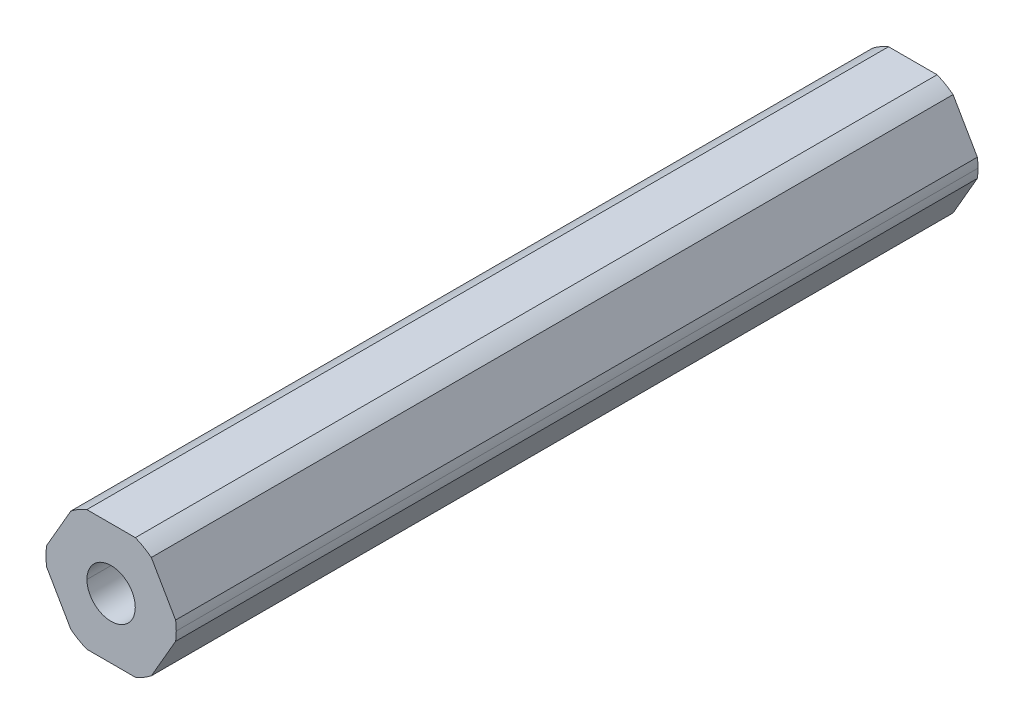
ISO-10303-21;
HEADER;
FILE_DESCRIPTION(('STEP AP214'),'2;1');
FILE_NAME('part.step','',(''),(''),'','','');
FILE_SCHEMA(('AUTOMOTIVE_DESIGN { 1 0 10303 214 1 1 1 1 }'));
ENDSEC;
DATA;
#1=APPLICATION_CONTEXT('core data for automotive mechanical design processes');
#2=APPLICATION_PROTOCOL_DEFINITION('international standard','automotive_design',2000,#1);
#3=PRODUCT_CONTEXT('',#1,'mechanical');
#4=PRODUCT('Part','Part','',(#3));
#5=PRODUCT_RELATED_PRODUCT_CATEGORY('part','',(#4));
#6=PRODUCT_DEFINITION_FORMATION('','',#4);
#7=PRODUCT_DEFINITION_CONTEXT('part definition',#1,'design');
#8=PRODUCT_DEFINITION('design','',#6,#7);
#9=PRODUCT_DEFINITION_SHAPE('','',#8);
#10=(LENGTH_UNIT() NAMED_UNIT(*) SI_UNIT(.MILLI.,.METRE.));
#11=(NAMED_UNIT(*) PLANE_ANGLE_UNIT() SI_UNIT($,.RADIAN.));
#12=(NAMED_UNIT(*) SI_UNIT($,.STERADIAN.) SOLID_ANGLE_UNIT());
#13=UNCERTAINTY_MEASURE_WITH_UNIT(LENGTH_MEASURE(1.E-05),#10,'distance_accuracy_value','');
#14=(GEOMETRIC_REPRESENTATION_CONTEXT(3) GLOBAL_UNCERTAINTY_ASSIGNED_CONTEXT((#13)) GLOBAL_UNIT_ASSIGNED_CONTEXT((#10,
#11,#12)) REPRESENTATION_CONTEXT('',''));
#15=CARTESIAN_POINT('',(0.,0.,0.));
#16=DIRECTION('',(0.,0.,1.));
#17=DIRECTION('',(1.,0.,0.));
#18=AXIS2_PLACEMENT_3D('',#15,#16,#17);
#19=CARTESIAN_POINT('',(0.,0.,-228.6));
#20=DIRECTION('',(0.,0.,1.));
#21=DIRECTION('',(1.,0.,0.));
#22=AXIS2_PLACEMENT_3D('',#19,#20,#21);
#23=CYLINDRICAL_SURFACE('',#22,2.55);
#24=DIRECTION('',(0.,0.,1.));
#25=VECTOR('',#24,1.);
#26=CARTESIAN_POINT('',(-2.55,0.,-228.6));
#27=LINE('',#26,#25);
#28=CARTESIAN_POINT('',(-2.55,0.,-228.6));
#29=VERTEX_POINT('',#28);
#30=CARTESIAN_POINT('',(-2.55,0.,-144.0764));
#31=VERTEX_POINT('',#30);
#32=EDGE_CURVE('E46',#29,#31,#27,.T.);
#33=ORIENTED_EDGE('',*,*,#32,.T.);
#34=CARTESIAN_POINT('',(0.,0.,-144.0764));
#35=DIRECTION('',(0.,0.,-1.));
#36=DIRECTION('',(-1.,0.,0.));
#37=AXIS2_PLACEMENT_3D('',#34,#35,#36);
#38=CIRCLE('',#37,2.55);
#39=CARTESIAN_POINT('',(2.55,0.,-144.0764));
#40=VERTEX_POINT('',#39);
#41=EDGE_CURVE('E60',#31,#40,#38,.F.);
#42=ORIENTED_EDGE('',*,*,#41,.T.);
#43=DIRECTION('',(0.,0.,1.));
#44=VECTOR('',#43,1.);
#45=CARTESIAN_POINT('',(2.55,0.,-228.6));
#46=LINE('',#45,#44);
#47=CARTESIAN_POINT('',(2.55,0.,-228.6));
#48=VERTEX_POINT('',#47);
#49=EDGE_CURVE('E192',#48,#40,#46,.T.);
#50=ORIENTED_EDGE('',*,*,#49,.F.);
#51=CARTESIAN_POINT('',(0.,0.,-228.6));
#52=DIRECTION('',(0.,0.,1.));
#53=DIRECTION('',(1.,0.,0.));
#54=AXIS2_PLACEMENT_3D('',#51,#52,#53);
#55=CIRCLE('',#54,2.55);
#56=EDGE_CURVE('E245',#29,#48,#55,.T.);
#57=ORIENTED_EDGE('',*,*,#56,.F.);
#58=EDGE_LOOP('',(#33,#42,#50,#57));
#59=FACE_BOUND('',#58,.T.);
#60=ADVANCED_FACE('F38',(#59),#23,.F.);
#61=CARTESIAN_POINT('',(0.,0.,-228.6));
#62=DIRECTION('',(0.,0.,1.));
#63=DIRECTION('',(1.,0.,0.));
#64=AXIS2_PLACEMENT_3D('',#61,#62,#63);
#65=CYLINDRICAL_SURFACE('',#64,6.87);
#66=CARTESIAN_POINT('',(0.,0.,-144.0764));
#67=DIRECTION('',(0.,0.,-1.));
#68=DIRECTION('',(-1.,0.,0.));
#69=AXIS2_PLACEMENT_3D('',#66,#67,#68);
#70=CIRCLE('',#69,6.87);
#71=CARTESIAN_POINT('',(6.80102150534208,-0.971085209378956,-144.0764));
#72=VERTEX_POINT('',#71);
#73=CARTESIAN_POINT('',(6.87,0.,-144.0764));
#74=VERTEX_POINT('',#73);
#75=EDGE_CURVE('E160',#72,#74,#70,.F.);
#76=ORIENTED_EDGE('',*,*,#75,.F.);
#77=DIRECTION('',(0.,0.,-1.));
#78=VECTOR('',#77,1.);
#79=CARTESIAN_POINT('',(6.80102150534208,-0.971085209378962,-228.6));
#80=LINE('',#79,#78);
#81=CARTESIAN_POINT('',(6.80102150534208,-0.971085209378955,-228.6));
#82=VERTEX_POINT('',#81);
#83=EDGE_CURVE('E173',#72,#82,#80,.T.);
#84=ORIENTED_EDGE('',*,*,#83,.T.);
#85=CARTESIAN_POINT('',(0.,0.,-228.6));
#86=DIRECTION('',(0.,0.,1.));
#87=DIRECTION('',(1.,0.,0.));
#88=AXIS2_PLACEMENT_3D('',#85,#86,#87);
#89=CIRCLE('',#88,6.87);
#90=CARTESIAN_POINT('',(6.87,0.,-228.6));
#91=VERTEX_POINT('',#90);
#92=EDGE_CURVE('E183',#82,#91,#89,.T.);
#93=ORIENTED_EDGE('',*,*,#92,.T.);
#94=DIRECTION('',(0.,0.,1.));
#95=VECTOR('',#94,1.);
#96=CARTESIAN_POINT('',(6.87,0.,-228.6));
#97=LINE('',#96,#95);
#98=EDGE_CURVE('E175',#91,#74,#97,.T.);
#99=ORIENTED_EDGE('',*,*,#98,.T.);
#100=EDGE_LOOP('',(#76,#84,#93,#99));
#101=FACE_BOUND('',#100,.T.);
#102=ADVANCED_FACE('F171',(#101),#65,.T.);
#103=CARTESIAN_POINT('',(3.68083890619154,-6.3754,228.6));
#104=DIRECTION('',(-0.866025403784439,0.5,0.));
#105=DIRECTION('',(0.,0.,1.));
#106=AXIS2_PLACEMENT_3D('',#103,#104,#105);
#107=PLANE('',#106);
#108=ORIENTED_EDGE('',*,*,#83,.F.);
#109=DIRECTION('',(0.500000000000001,0.866025403784438,0.));
#110=VECTOR('',#109,1.);
#111=CARTESIAN_POINT('',(4.24149521323254,-5.40431479062105,-144.0764));
#112=LINE('',#111,#110);
#113=CARTESIAN_POINT('',(4.24149521323254,-5.40431479062105,-144.0764));
#114=VERTEX_POINT('',#113);
#115=EDGE_CURVE('E157',#114,#72,#112,.T.);
#116=ORIENTED_EDGE('',*,*,#115,.F.);
#117=DIRECTION('',(0.,0.,1.));
#118=VECTOR('',#117,1.);
#119=CARTESIAN_POINT('',(4.24149521323255,-5.40431479062104,-228.6));
#120=LINE('',#119,#118);
#121=CARTESIAN_POINT('',(4.24149521323254,-5.40431479062105,-228.6));
#122=VERTEX_POINT('',#121);
#123=EDGE_CURVE('E244',#122,#114,#120,.T.);
#124=ORIENTED_EDGE('',*,*,#123,.F.);
#125=DIRECTION('',(0.5,0.866025403784439,0.));
#126=VECTOR('',#125,1.);
#127=CARTESIAN_POINT('',(3.68083890619154,-6.3754,-228.6));
#128=LINE('',#127,#126);
#129=EDGE_CURVE('E180',#122,#82,#128,.T.);
#130=ORIENTED_EDGE('',*,*,#129,.T.);
#131=EDGE_LOOP('',(#108,#116,#124,#130));
#132=FACE_BOUND('',#131,.T.);
#133=ADVANCED_FACE('F178',(#132),#107,.F.);
#134=CARTESIAN_POINT('',(7.36167781238308,0.,228.6));
#135=DIRECTION('',(-0.866025403784439,-0.5,0.));
#136=DIRECTION('',(-0.5,0.866025403784439,0.));
#137=AXIS2_PLACEMENT_3D('',#134,#135,#136);
#138=PLANE('',#137);
#139=DIRECTION('',(0.,0.,-1.));
#140=VECTOR('',#139,1.);
#141=CARTESIAN_POINT('',(4.24149521323254,5.40431479062105,-228.6));
#142=LINE('',#141,#140);
#143=CARTESIAN_POINT('',(4.24149521323254,5.40431479062105,-144.0764));
#144=VERTEX_POINT('',#143);
#145=CARTESIAN_POINT('',(4.24149521323254,5.40431479062105,-228.6));
#146=VERTEX_POINT('',#145);
#147=EDGE_CURVE('E211',#144,#146,#142,.T.);
#148=ORIENTED_EDGE('',*,*,#147,.F.);
#149=DIRECTION('',(-0.5,0.866025403784439,0.));
#150=VECTOR('',#149,1.);
#151=CARTESIAN_POINT('',(6.80102150534208,0.97108520937895,-144.0764));
#152=LINE('',#151,#150);
#153=CARTESIAN_POINT('',(6.80102150534208,0.97108520937895,-144.0764));
#154=VERTEX_POINT('',#153);
#155=EDGE_CURVE('E53',#154,#144,#152,.T.);
#156=ORIENTED_EDGE('',*,*,#155,.F.);
#157=DIRECTION('',(0.,0.,1.));
#158=VECTOR('',#157,1.);
#159=CARTESIAN_POINT('',(6.80102150534208,0.971085209378949,-228.6));
#160=LINE('',#159,#158);
#161=CARTESIAN_POINT('',(6.80102150534208,0.97108520937895,-228.6));
#162=VERTEX_POINT('',#161);
#163=EDGE_CURVE('E239',#162,#154,#160,.T.);
#164=ORIENTED_EDGE('',*,*,#163,.F.);
#165=DIRECTION('',(-0.5,0.866025403784439,0.));
#166=VECTOR('',#165,1.);
#167=CARTESIAN_POINT('',(7.36167781238308,0.,-228.6));
#168=LINE('',#167,#166);
#169=EDGE_CURVE('E186',#162,#146,#168,.T.);
#170=ORIENTED_EDGE('',*,*,#169,.T.);
#171=EDGE_LOOP('',(#148,#156,#164,#170));
#172=FACE_BOUND('',#171,.T.);
#173=ADVANCED_FACE('F361',(#172),#138,.F.);
#174=CARTESIAN_POINT('',(3.68083890619154,6.3754,228.6));
#175=DIRECTION('',(0.,-1.,0.));
#176=DIRECTION('',(0.,0.,-1.));
#177=AXIS2_PLACEMENT_3D('',#174,#175,#176);
#178=PLANE('',#177);
#179=DIRECTION('',(0.,0.,-1.));
#180=VECTOR('',#179,1.);
#181=CARTESIAN_POINT('',(-2.55952629210953,6.3754,-228.6));
#182=LINE('',#181,#180);
#183=CARTESIAN_POINT('',(-2.55952629210953,6.3754,-144.0764));
#184=VERTEX_POINT('',#183);
#185=CARTESIAN_POINT('',(-2.55952629210953,6.3754,-228.6));
#186=VERTEX_POINT('',#185);
#187=EDGE_CURVE('E209',#184,#186,#182,.T.);
#188=ORIENTED_EDGE('',*,*,#187,.F.);
#189=DIRECTION('',(-1.,0.,0.));
#190=VECTOR('',#189,1.);
#191=CARTESIAN_POINT('',(2.55952629210953,6.3754,-144.0764));
#192=LINE('',#191,#190);
#193=CARTESIAN_POINT('',(2.55952629210953,6.3754,-144.0764));
#194=VERTEX_POINT('',#193);
#195=EDGE_CURVE('E314',#194,#184,#192,.T.);
#196=ORIENTED_EDGE('',*,*,#195,.F.);
#197=DIRECTION('',(0.,0.,1.));
#198=VECTOR('',#197,1.);
#199=CARTESIAN_POINT('',(2.55952629210952,6.3754,-228.6));
#200=LINE('',#199,#198);
#201=CARTESIAN_POINT('',(2.55952629210952,6.3754,-228.6));
#202=VERTEX_POINT('',#201);
#203=EDGE_CURVE('E196',#202,#194,#200,.T.);
#204=ORIENTED_EDGE('',*,*,#203,.F.);
#205=DIRECTION('',(-1.,0.,0.));
#206=VECTOR('',#205,1.);
#207=CARTESIAN_POINT('',(3.68083890619154,6.3754,-228.6));
#208=LINE('',#207,#206);
#209=EDGE_CURVE('E202',#202,#186,#208,.T.);
#210=ORIENTED_EDGE('',*,*,#209,.T.);
#211=EDGE_LOOP('',(#188,#196,#204,#210));
#212=FACE_BOUND('',#211,.T.);
#213=ADVANCED_FACE('F334',(#212),#178,.F.);
#214=CARTESIAN_POINT('',(-3.68083890619154,6.3754,228.6));
#215=DIRECTION('',(0.866025403784439,-0.5,0.));
#216=DIRECTION('',(0.,0.,-1.));
#217=AXIS2_PLACEMENT_3D('',#214,#215,#216);
#218=PLANE('',#217);
#219=DIRECTION('',(0.,0.,-1.));
#220=VECTOR('',#219,1.);
#221=CARTESIAN_POINT('',(-6.80102150534208,0.97108520937896,-228.6));
#222=LINE('',#221,#220);
#223=CARTESIAN_POINT('',(-6.80102150534208,0.971085209378959,-144.0764));
#224=VERTEX_POINT('',#223);
#225=CARTESIAN_POINT('',(-6.80102150534208,0.97108520937896,-228.6));
#226=VERTEX_POINT('',#225);
#227=EDGE_CURVE('E255',#224,#226,#222,.T.);
#228=ORIENTED_EDGE('',*,*,#227,.F.);
#229=DIRECTION('',(-0.5,-0.866025403784439,0.));
#230=VECTOR('',#229,1.);
#231=CARTESIAN_POINT('',(-4.24149521323255,5.40431479062105,-144.0764));
#232=LINE('',#231,#230);
#233=CARTESIAN_POINT('',(-4.24149521323254,5.40431479062105,-144.0764));
#234=VERTEX_POINT('',#233);
#235=EDGE_CURVE('E310',#234,#224,#232,.T.);
#236=ORIENTED_EDGE('',*,*,#235,.F.);
#237=DIRECTION('',(0.,0.,1.));
#238=VECTOR('',#237,1.);
#239=CARTESIAN_POINT('',(-4.24149521323255,5.40431479062105,-228.6));
#240=LINE('',#239,#238);
#241=CARTESIAN_POINT('',(-4.24149521323255,5.40431479062105,-228.6));
#242=VERTEX_POINT('',#241);
#243=EDGE_CURVE('E210',#242,#234,#240,.T.);
#244=ORIENTED_EDGE('',*,*,#243,.F.);
#245=DIRECTION('',(-0.5,-0.866025403784439,0.));
#246=VECTOR('',#245,1.);
#247=CARTESIAN_POINT('',(-3.68083890619154,6.3754,-228.6));
#248=LINE('',#247,#246);
#249=EDGE_CURVE('E199',#242,#226,#248,.T.);
#250=ORIENTED_EDGE('',*,*,#249,.T.);
#251=EDGE_LOOP('',(#228,#236,#244,#250));
#252=FACE_BOUND('',#251,.T.);
#253=ADVANCED_FACE('F372',(#252),#218,.F.);
#254=CARTESIAN_POINT('',(-7.36167781238308,0.,228.6));
#255=DIRECTION('',(0.866025403784439,0.5,0.));
#256=DIRECTION('',(0.,0.,-1.));
#257=AXIS2_PLACEMENT_3D('',#254,#255,#256);
#258=PLANE('',#257);
#259=DIRECTION('',(0.,0.,-1.));
#260=VECTOR('',#259,1.);
#261=CARTESIAN_POINT('',(-4.24149521323255,-5.40431479062104,-228.6));
#262=LINE('',#261,#260);
#263=CARTESIAN_POINT('',(-4.24149521323254,-5.40431479062105,-144.0764));
#264=VERTEX_POINT('',#263);
#265=CARTESIAN_POINT('',(-4.24149521323254,-5.40431479062105,-228.6));
#266=VERTEX_POINT('',#265);
#267=EDGE_CURVE('E238',#264,#266,#262,.T.);
#268=ORIENTED_EDGE('',*,*,#267,.F.);
#269=DIRECTION('',(0.5,-0.866025403784439,0.));
#270=VECTOR('',#269,1.);
#271=CARTESIAN_POINT('',(-6.80102150534208,-0.971085209378954,-144.0764));
#272=LINE('',#271,#270);
#273=CARTESIAN_POINT('',(-6.80102150534208,-0.971085209378951,-144.0764));
#274=VERTEX_POINT('',#273);
#275=EDGE_CURVE('E304',#274,#264,#272,.T.);
#276=ORIENTED_EDGE('',*,*,#275,.F.);
#277=DIRECTION('',(0.,0.,1.));
#278=VECTOR('',#277,1.);
#279=CARTESIAN_POINT('',(-6.80102150534208,-0.971085209378962,-228.6));
#280=LINE('',#279,#278);
#281=CARTESIAN_POINT('',(-6.80102150534208,-0.971085209378956,-228.6));
#282=VERTEX_POINT('',#281);
#283=EDGE_CURVE('E217',#282,#274,#280,.T.);
#284=ORIENTED_EDGE('',*,*,#283,.F.);
#285=DIRECTION('',(0.5,-0.866025403784439,0.));
#286=VECTOR('',#285,1.);
#287=CARTESIAN_POINT('',(-7.36167781238308,0.,-228.6));
#288=LINE('',#287,#286);
#289=EDGE_CURVE('E203',#282,#266,#288,.T.);
#290=ORIENTED_EDGE('',*,*,#289,.T.);
#291=EDGE_LOOP('',(#268,#276,#284,#290));
#292=FACE_BOUND('',#291,.T.);
#293=ADVANCED_FACE('F288',(#292),#258,.F.);
#294=CARTESIAN_POINT('',(-3.68083890619154,-6.3754,228.6));
#295=DIRECTION('',(0.,1.,0.));
#296=DIRECTION('',(1.,0.,0.));
#297=AXIS2_PLACEMENT_3D('',#294,#295,#296);
#298=PLANE('',#297);
#299=DIRECTION('',(0.,0.,-1.));
#300=VECTOR('',#299,1.);
#301=CARTESIAN_POINT('',(2.55952629210953,-6.3754,-228.6));
#302=LINE('',#301,#300);
#303=CARTESIAN_POINT('',(2.55952629210953,-6.3754,-144.0764));
#304=VERTEX_POINT('',#303);
#305=CARTESIAN_POINT('',(2.55952629210953,-6.3754,-228.6));
#306=VERTEX_POINT('',#305);
#307=EDGE_CURVE('E237',#304,#306,#302,.T.);
#308=ORIENTED_EDGE('',*,*,#307,.F.);
#309=DIRECTION('',(1.,0.,0.));
#310=VECTOR('',#309,1.);
#311=CARTESIAN_POINT('',(-2.55952629210953,-6.3754,-144.0764));
#312=LINE('',#311,#310);
#313=CARTESIAN_POINT('',(-2.55952629210953,-6.37540000000001,-144.0764));
#314=VERTEX_POINT('',#313);
#315=EDGE_CURVE('E301',#314,#304,#312,.T.);
#316=ORIENTED_EDGE('',*,*,#315,.F.);
#317=DIRECTION('',(0.,0.,1.));
#318=VECTOR('',#317,1.);
#319=CARTESIAN_POINT('',(-2.55952629210953,-6.3754,-228.6));
#320=LINE('',#319,#318);
#321=CARTESIAN_POINT('',(-2.55952629210953,-6.3754,-228.6));
#322=VERTEX_POINT('',#321);
#323=EDGE_CURVE('E257',#322,#314,#320,.T.);
#324=ORIENTED_EDGE('',*,*,#323,.F.);
#325=DIRECTION('',(1.,0.,0.));
#326=VECTOR('',#325,1.);
#327=CARTESIAN_POINT('',(-3.68083890619154,-6.3754,-228.6));
#328=LINE('',#327,#326);
#329=EDGE_CURVE('E268',#322,#306,#328,.T.);
#330=ORIENTED_EDGE('',*,*,#329,.T.);
#331=EDGE_LOOP('',(#308,#316,#324,#330));
#332=FACE_BOUND('',#331,.T.);
#333=ADVANCED_FACE('F299',(#332),#298,.F.);
#334=CARTESIAN_POINT('',(0.,0.,-228.6));
#335=DIRECTION('',(0.,0.,1.));
#336=DIRECTION('',(1.,0.,0.));
#337=AXIS2_PLACEMENT_3D('',#334,#335,#336);
#338=PLANE('',#337);
#339=CARTESIAN_POINT('',(0.,0.,-228.6));
#340=DIRECTION('',(0.,0.,1.));
#341=DIRECTION('',(1.,0.,0.));
#342=AXIS2_PLACEMENT_3D('',#339,#340,#341);
#343=CIRCLE('',#342,6.87);
#344=EDGE_CURVE('E213',#146,#202,#343,.T.);
#345=ORIENTED_EDGE('',*,*,#344,.F.);
#346=ORIENTED_EDGE('',*,*,#169,.F.);
#347=CARTESIAN_POINT('',(0.,0.,-228.6));
#348=DIRECTION('',(0.,0.,1.));
#349=DIRECTION('',(1.,0.,0.));
#350=AXIS2_PLACEMENT_3D('',#347,#348,#349);
#351=CIRCLE('',#350,6.87);
#352=EDGE_CURVE('E243',#91,#162,#351,.T.);
#353=ORIENTED_EDGE('',*,*,#352,.F.);
#354=ORIENTED_EDGE('',*,*,#92,.F.);
#355=ORIENTED_EDGE('',*,*,#129,.F.);
#356=CARTESIAN_POINT('',(0.,0.,-228.6));
#357=DIRECTION('',(0.,0.,1.));
#358=DIRECTION('',(1.,0.,0.));
#359=AXIS2_PLACEMENT_3D('',#356,#357,#358);
#360=CIRCLE('',#359,6.87);
#361=EDGE_CURVE('E233',#306,#122,#360,.T.);
#362=ORIENTED_EDGE('',*,*,#361,.F.);
#363=ORIENTED_EDGE('',*,*,#329,.F.);
#364=CARTESIAN_POINT('',(0.,0.,-228.6));
#365=DIRECTION('',(0.,0.,1.));
#366=DIRECTION('',(1.,0.,0.));
#367=AXIS2_PLACEMENT_3D('',#364,#365,#366);
#368=CIRCLE('',#367,6.87);
#369=EDGE_CURVE('E264',#266,#322,#368,.T.);
#370=ORIENTED_EDGE('',*,*,#369,.F.);
#371=ORIENTED_EDGE('',*,*,#289,.F.);
#372=CARTESIAN_POINT('',(0.,0.,-228.6));
#373=DIRECTION('',(0.,0.,1.));
#374=DIRECTION('',(1.,0.,0.));
#375=AXIS2_PLACEMENT_3D('',#372,#373,#374);
#376=CIRCLE('',#375,6.87);
#377=EDGE_CURVE('E258',#226,#282,#376,.T.);
#378=ORIENTED_EDGE('',*,*,#377,.F.);
#379=ORIENTED_EDGE('',*,*,#249,.F.);
#380=CARTESIAN_POINT('',(0.,0.,-228.6));
#381=DIRECTION('',(0.,0.,1.));
#382=DIRECTION('',(1.,0.,0.));
#383=AXIS2_PLACEMENT_3D('',#380,#381,#382);
#384=CIRCLE('',#383,6.87);
#385=EDGE_CURVE('E205',#186,#242,#384,.T.);
#386=ORIENTED_EDGE('',*,*,#385,.F.);
#387=ORIENTED_EDGE('',*,*,#209,.F.);
#388=EDGE_LOOP('',(#345,#346,#353,#354,#355,#362,#363,#370,#371,#378,#379,#386,#387));
#389=FACE_BOUND('',#388,.T.);
#390=CARTESIAN_POINT('',(0.,0.,-228.6));
#391=DIRECTION('',(0.,0.,1.));
#392=DIRECTION('',(1.,0.,0.));
#393=AXIS2_PLACEMENT_3D('',#390,#391,#392);
#394=CIRCLE('',#393,2.55);
#395=EDGE_CURVE('E190',#48,#29,#394,.T.);
#396=ORIENTED_EDGE('',*,*,#395,.T.);
#397=ORIENTED_EDGE('',*,*,#56,.T.);
#398=EDGE_LOOP('',(#396,#397));
#399=FACE_BOUND('',#398,.T.);
#400=ADVANCED_FACE('F40',(#389,#399),#338,.F.);
#401=CARTESIAN_POINT('',(0.,0.,-228.6));
#402=DIRECTION('',(0.,0.,1.));
#403=DIRECTION('',(1.,0.,0.));
#404=AXIS2_PLACEMENT_3D('',#401,#402,#403);
#405=CYLINDRICAL_SURFACE('',#404,6.87);
#406=EDGE_CURVE('E167',#74,#154,#70,.F.);
#407=ORIENTED_EDGE('',*,*,#406,.F.);
#408=ORIENTED_EDGE('',*,*,#98,.F.);
#409=ORIENTED_EDGE('',*,*,#352,.T.);
#410=ORIENTED_EDGE('',*,*,#163,.T.);
#411=EDGE_LOOP('',(#407,#408,#409,#410));
#412=FACE_BOUND('',#411,.T.);
#413=ADVANCED_FACE('F340',(#412),#405,.T.);
#414=CARTESIAN_POINT('',(0.,0.,-228.6));
#415=DIRECTION('',(0.,0.,1.));
#416=DIRECTION('',(1.,0.,0.));
#417=AXIS2_PLACEMENT_3D('',#414,#415,#416);
#418=CYLINDRICAL_SURFACE('',#417,6.87);
#419=CARTESIAN_POINT('',(0.,0.,-144.0764));
#420=DIRECTION('',(0.,0.,-1.));
#421=DIRECTION('',(-1.,0.,0.));
#422=AXIS2_PLACEMENT_3D('',#419,#420,#421);
#423=CIRCLE('',#422,6.87);
#424=EDGE_CURVE('E163',#304,#114,#423,.F.);
#425=ORIENTED_EDGE('',*,*,#424,.F.);
#426=ORIENTED_EDGE('',*,*,#307,.T.);
#427=ORIENTED_EDGE('',*,*,#361,.T.);
#428=ORIENTED_EDGE('',*,*,#123,.T.);
#429=EDGE_LOOP('',(#425,#426,#427,#428));
#430=FACE_BOUND('',#429,.T.);
#431=ADVANCED_FACE('F342',(#430),#418,.T.);
#432=CARTESIAN_POINT('',(0.,0.,-228.6));
#433=DIRECTION('',(0.,0.,1.));
#434=DIRECTION('',(1.,0.,0.));
#435=AXIS2_PLACEMENT_3D('',#432,#433,#434);
#436=CYLINDRICAL_SURFACE('',#435,6.87);
#437=CARTESIAN_POINT('',(0.,0.,-144.0764));
#438=DIRECTION('',(0.,0.,-1.));
#439=DIRECTION('',(-1.,0.,0.));
#440=AXIS2_PLACEMENT_3D('',#437,#438,#439);
#441=CIRCLE('',#440,6.87);
#442=EDGE_CURVE('E284',#264,#314,#441,.F.);
#443=ORIENTED_EDGE('',*,*,#442,.F.);
#444=ORIENTED_EDGE('',*,*,#267,.T.);
#445=ORIENTED_EDGE('',*,*,#369,.T.);
#446=ORIENTED_EDGE('',*,*,#323,.T.);
#447=EDGE_LOOP('',(#443,#444,#445,#446));
#448=FACE_BOUND('',#447,.T.);
#449=ADVANCED_FACE('F282',(#448),#436,.T.);
#450=CARTESIAN_POINT('',(0.,0.,-228.6));
#451=DIRECTION('',(0.,0.,1.));
#452=DIRECTION('',(1.,0.,0.));
#453=AXIS2_PLACEMENT_3D('',#450,#451,#452);
#454=CYLINDRICAL_SURFACE('',#453,6.87);
#455=CARTESIAN_POINT('',(0.,0.,-144.0764));
#456=DIRECTION('',(0.,0.,-1.));
#457=DIRECTION('',(-1.,0.,0.));
#458=AXIS2_PLACEMENT_3D('',#455,#456,#457);
#459=CIRCLE('',#458,6.87);
#460=EDGE_CURVE('E308',#224,#274,#459,.F.);
#461=ORIENTED_EDGE('',*,*,#460,.F.);
#462=ORIENTED_EDGE('',*,*,#227,.T.);
#463=ORIENTED_EDGE('',*,*,#377,.T.);
#464=ORIENTED_EDGE('',*,*,#283,.T.);
#465=EDGE_LOOP('',(#461,#462,#463,#464));
#466=FACE_BOUND('',#465,.T.);
#467=ADVANCED_FACE('F322',(#466),#454,.T.);
#468=CARTESIAN_POINT('',(0.,0.,-228.6));
#469=DIRECTION('',(0.,0.,1.));
#470=DIRECTION('',(1.,0.,0.));
#471=AXIS2_PLACEMENT_3D('',#468,#469,#470);
#472=CYLINDRICAL_SURFACE('',#471,6.87);
#473=CARTESIAN_POINT('',(0.,0.,-144.0764));
#474=DIRECTION('',(0.,0.,-1.));
#475=DIRECTION('',(-1.,0.,0.));
#476=AXIS2_PLACEMENT_3D('',#473,#474,#475);
#477=CIRCLE('',#476,6.87);
#478=EDGE_CURVE('E312',#184,#234,#477,.F.);
#479=ORIENTED_EDGE('',*,*,#478,.F.);
#480=ORIENTED_EDGE('',*,*,#187,.T.);
#481=ORIENTED_EDGE('',*,*,#385,.T.);
#482=ORIENTED_EDGE('',*,*,#243,.T.);
#483=EDGE_LOOP('',(#479,#480,#481,#482));
#484=FACE_BOUND('',#483,.T.);
#485=ADVANCED_FACE('F330',(#484),#472,.T.);
#486=CARTESIAN_POINT('',(0.,0.,-228.6));
#487=DIRECTION('',(0.,0.,1.));
#488=DIRECTION('',(1.,0.,0.));
#489=AXIS2_PLACEMENT_3D('',#486,#487,#488);
#490=CYLINDRICAL_SURFACE('',#489,6.87);
#491=CARTESIAN_POINT('',(0.,0.,-144.0764));
#492=DIRECTION('',(0.,0.,-1.));
#493=DIRECTION('',(-1.,0.,0.));
#494=AXIS2_PLACEMENT_3D('',#491,#492,#493);
#495=CIRCLE('',#494,6.87);
#496=EDGE_CURVE('E316',#144,#194,#495,.F.);
#497=ORIENTED_EDGE('',*,*,#496,.F.);
#498=ORIENTED_EDGE('',*,*,#147,.T.);
#499=ORIENTED_EDGE('',*,*,#344,.T.);
#500=ORIENTED_EDGE('',*,*,#203,.T.);
#501=EDGE_LOOP('',(#497,#498,#499,#500));
#502=FACE_BOUND('',#501,.T.);
#503=ADVANCED_FACE('F365',(#502),#490,.T.);
#504=CARTESIAN_POINT('',(0.,0.,-228.6));
#505=DIRECTION('',(0.,0.,1.));
#506=DIRECTION('',(1.,0.,0.));
#507=AXIS2_PLACEMENT_3D('',#504,#505,#506);
#508=CYLINDRICAL_SURFACE('',#507,2.55);
#509=ORIENTED_EDGE('',*,*,#49,.T.);
#510=CARTESIAN_POINT('',(0.,0.,-144.0764));
#511=DIRECTION('',(0.,0.,-1.));
#512=DIRECTION('',(-1.,0.,0.));
#513=AXIS2_PLACEMENT_3D('',#510,#511,#512);
#514=CIRCLE('',#513,2.55);
#515=EDGE_CURVE('E11',#40,#31,#514,.F.);
#516=ORIENTED_EDGE('',*,*,#515,.T.);
#517=ORIENTED_EDGE('',*,*,#32,.F.);
#518=ORIENTED_EDGE('',*,*,#395,.F.);
#519=EDGE_LOOP('',(#509,#516,#517,#518));
#520=FACE_BOUND('',#519,.T.);
#521=ADVANCED_FACE('F366',(#520),#508,.F.);
#522=CARTESIAN_POINT('',(-131.561284874292,-29.1036767092964,-144.0764));
#523=DIRECTION('',(0.,0.,-1.));
#524=DIRECTION('',(-0.926669174308986,0.375877960760542,0.));
#525=AXIS2_PLACEMENT_3D('',#522,#523,#524);
#526=PLANE('',#525);
#527=ORIENTED_EDGE('',*,*,#75,.T.);
#528=ORIENTED_EDGE('',*,*,#406,.T.);
#529=ORIENTED_EDGE('',*,*,#155,.T.);
#530=ORIENTED_EDGE('',*,*,#496,.T.);
#531=ORIENTED_EDGE('',*,*,#195,.T.);
#532=ORIENTED_EDGE('',*,*,#478,.T.);
#533=ORIENTED_EDGE('',*,*,#235,.T.);
#534=ORIENTED_EDGE('',*,*,#460,.T.);
#535=ORIENTED_EDGE('',*,*,#275,.T.);
#536=ORIENTED_EDGE('',*,*,#442,.T.);
#537=ORIENTED_EDGE('',*,*,#315,.T.);
#538=ORIENTED_EDGE('',*,*,#424,.T.);
#539=ORIENTED_EDGE('',*,*,#115,.T.);
#540=EDGE_LOOP('',(#527,#528,#529,#530,#531,#532,#533,#534,#535,#536,#537,#538,#539));
#541=FACE_BOUND('',#540,.T.);
#542=ORIENTED_EDGE('',*,*,#515,.F.);
#543=ORIENTED_EDGE('',*,*,#41,.F.);
#544=EDGE_LOOP('',(#542,#543));
#545=FACE_BOUND('',#544,.T.);
#546=ADVANCED_FACE('F159',(#541,#545),#526,.F.);
#547=CLOSED_SHELL('',(#60,#102,#133,#173,#213,#253,#293,#333,#400,#413,#431,#449,#467,#485,#503,
#521,#546));
#548=MANIFOLD_SOLID_BREP('B2',#547);
#549=ADVANCED_BREP_SHAPE_REPRESENTATION('',(#18,#548),#14);
#550=SHAPE_DEFINITION_REPRESENTATION(#9,#549);
ENDSEC;
END-ISO-10303-21;
